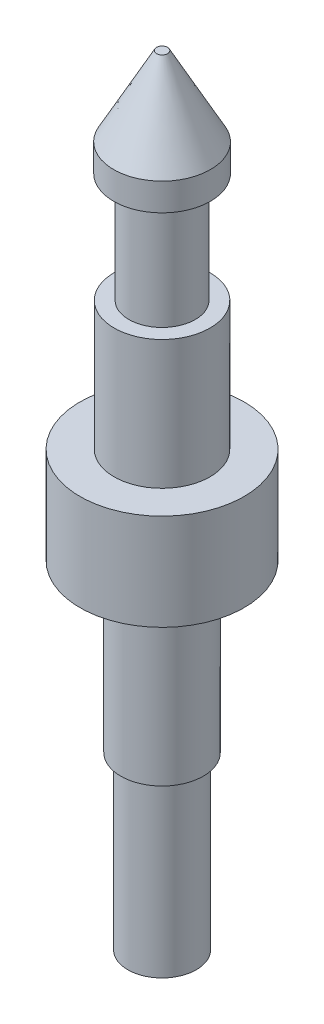
ISO-10303-21;
HEADER;
FILE_DESCRIPTION(('STEP AP214'),'2;1');
FILE_NAME('part.step','',(''),(''),'','','');
FILE_SCHEMA(('AUTOMOTIVE_DESIGN { 1 0 10303 214 1 1 1 1 }'));
ENDSEC;
DATA;
#1=APPLICATION_CONTEXT('core data for automotive mechanical design processes');
#2=APPLICATION_PROTOCOL_DEFINITION('international standard','automotive_design',2000,#1);
#3=PRODUCT_CONTEXT('',#1,'mechanical');
#4=PRODUCT('Part','Part','',(#3));
#5=PRODUCT_RELATED_PRODUCT_CATEGORY('part','',(#4));
#6=PRODUCT_DEFINITION_FORMATION('','',#4);
#7=PRODUCT_DEFINITION_CONTEXT('part definition',#1,'design');
#8=PRODUCT_DEFINITION('design','',#6,#7);
#9=PRODUCT_DEFINITION_SHAPE('','',#8);
#10=(LENGTH_UNIT() NAMED_UNIT(*) SI_UNIT(.MILLI.,.METRE.));
#11=(NAMED_UNIT(*) PLANE_ANGLE_UNIT() SI_UNIT($,.RADIAN.));
#12=(NAMED_UNIT(*) SI_UNIT($,.STERADIAN.) SOLID_ANGLE_UNIT());
#13=UNCERTAINTY_MEASURE_WITH_UNIT(LENGTH_MEASURE(1.E-05),#10,'distance_accuracy_value','');
#14=(GEOMETRIC_REPRESENTATION_CONTEXT(3) GLOBAL_UNCERTAINTY_ASSIGNED_CONTEXT((#13)) GLOBAL_UNIT_ASSIGNED_CONTEXT((#10,
#11,#12)) REPRESENTATION_CONTEXT('',''));
#15=CARTESIAN_POINT('',(0.,0.,0.));
#16=DIRECTION('',(0.,0.,1.));
#17=DIRECTION('',(1.,0.,0.));
#18=AXIS2_PLACEMENT_3D('',#15,#16,#17);
#19=CARTESIAN_POINT('',(0.,0.,0.));
#20=DIRECTION('',(0.,-1.,0.));
#21=DIRECTION('',(0.,0.,-1.));
#22=AXIS2_PLACEMENT_3D('',#19,#20,#21);
#23=PLANE('',#22);
#24=CARTESIAN_POINT('',(0.,0.,0.));
#25=DIRECTION('',(0.,-1.,0.));
#26=DIRECTION('',(0.,0.,-1.));
#27=AXIS2_PLACEMENT_3D('',#24,#25,#26);
#28=CIRCLE('',#27,1.9812);
#29=CARTESIAN_POINT('',(0.,0.,-1.9812));
#30=VERTEX_POINT('',#29);
#31=EDGE_CURVE('E10',#30,#30,#28,.T.);
#32=ORIENTED_EDGE('',*,*,#31,.T.);
#33=EDGE_LOOP('',(#32));
#34=FACE_BOUND('',#33,.T.);
#35=ADVANCED_FACE('F33',(#34),#23,.T.);
#36=CARTESIAN_POINT('',(0.,0.,0.));
#37=DIRECTION('',(0.,-1.,0.));
#38=DIRECTION('',(0.,0.,-1.));
#39=AXIS2_PLACEMENT_3D('',#36,#37,#38);
#40=CYLINDRICAL_SURFACE('',#39,1.9812);
#41=CARTESIAN_POINT('',(0.,9.8806,0.));
#42=DIRECTION('',(0.,-1.,0.));
#43=DIRECTION('',(0.,0.,-1.));
#44=AXIS2_PLACEMENT_3D('',#41,#42,#43);
#45=CIRCLE('',#44,1.9812);
#46=CARTESIAN_POINT('',(0.,9.8806,-1.9812));
#47=VERTEX_POINT('',#46);
#48=EDGE_CURVE('E39',#47,#47,#45,.T.);
#49=ORIENTED_EDGE('',*,*,#48,.T.);
#50=EDGE_LOOP('',(#49));
#51=FACE_BOUND('',#50,.T.);
#52=ORIENTED_EDGE('',*,*,#31,.F.);
#53=EDGE_LOOP('',(#52));
#54=FACE_BOUND('',#53,.T.);
#55=ADVANCED_FACE('F92',(#51,#54),#40,.T.);
#56=CARTESIAN_POINT('',(2.38125,9.8806,0.));
#57=DIRECTION('',(0.,-1.,0.));
#58=DIRECTION('',(0.,0.,-1.));
#59=AXIS2_PLACEMENT_3D('',#56,#57,#58);
#60=PLANE('',#59);
#61=CARTESIAN_POINT('',(0.,9.8806,0.));
#62=DIRECTION('',(0.,-1.,0.));
#63=DIRECTION('',(0.,0.,-1.));
#64=AXIS2_PLACEMENT_3D('',#61,#62,#63);
#65=CIRCLE('',#64,2.38125);
#66=CARTESIAN_POINT('',(0.,9.8806,-2.38125));
#67=VERTEX_POINT('',#66);
#68=EDGE_CURVE('E43',#67,#67,#65,.T.);
#69=ORIENTED_EDGE('',*,*,#68,.T.);
#70=EDGE_LOOP('',(#69));
#71=FACE_BOUND('',#70,.T.);
#72=ORIENTED_EDGE('',*,*,#48,.F.);
#73=EDGE_LOOP('',(#72));
#74=FACE_BOUND('',#73,.T.);
#75=ADVANCED_FACE('F96',(#71,#74),#60,.T.);
#76=CARTESIAN_POINT('',(0.,0.,0.));
#77=DIRECTION('',(0.,-1.,0.));
#78=DIRECTION('',(0.,0.,-1.));
#79=AXIS2_PLACEMENT_3D('',#76,#77,#78);
#80=CYLINDRICAL_SURFACE('',#79,2.38125);
#81=CARTESIAN_POINT('',(0.,19.4818,0.));
#82=DIRECTION('',(0.,-1.,0.));
#83=DIRECTION('',(0.,0.,-1.));
#84=AXIS2_PLACEMENT_3D('',#81,#82,#83);
#85=CIRCLE('',#84,2.38125);
#86=CARTESIAN_POINT('',(0.,19.4818,-2.38125));
#87=VERTEX_POINT('',#86);
#88=EDGE_CURVE('E47',#87,#87,#85,.T.);
#89=ORIENTED_EDGE('',*,*,#88,.T.);
#90=EDGE_LOOP('',(#89));
#91=FACE_BOUND('',#90,.T.);
#92=ORIENTED_EDGE('',*,*,#68,.F.);
#93=EDGE_LOOP('',(#92));
#94=FACE_BOUND('',#93,.T.);
#95=ADVANCED_FACE('F100',(#91,#94),#80,.T.);
#96=CARTESIAN_POINT('',(2.38125,19.4818,0.));
#97=DIRECTION('',(0.,-1.,0.));
#98=DIRECTION('',(0.,0.,-1.));
#99=AXIS2_PLACEMENT_3D('',#96,#97,#98);
#100=PLANE('',#99);
#101=CARTESIAN_POINT('',(0.,19.4818,0.));
#102=DIRECTION('',(0.,-1.,0.));
#103=DIRECTION('',(0.,0.,-1.));
#104=AXIS2_PLACEMENT_3D('',#101,#102,#103);
#105=CIRCLE('',#104,4.7371);
#106=CARTESIAN_POINT('',(0.,19.4818,-4.7371));
#107=VERTEX_POINT('',#106);
#108=EDGE_CURVE('E52',#107,#107,#105,.T.);
#109=ORIENTED_EDGE('',*,*,#108,.T.);
#110=EDGE_LOOP('',(#109));
#111=FACE_BOUND('',#110,.T.);
#112=ORIENTED_EDGE('',*,*,#88,.F.);
#113=EDGE_LOOP('',(#112));
#114=FACE_BOUND('',#113,.T.);
#115=ADVANCED_FACE('F107',(#111,#114),#100,.T.);
#116=CARTESIAN_POINT('',(0.,0.,0.));
#117=DIRECTION('',(0.,-1.,0.));
#118=DIRECTION('',(0.,0.,-1.));
#119=AXIS2_PLACEMENT_3D('',#116,#117,#118);
#120=CYLINDRICAL_SURFACE('',#119,4.7371);
#121=CARTESIAN_POINT('',(0.,25.0444,0.));
#122=DIRECTION('',(0.,-1.,0.));
#123=DIRECTION('',(0.,0.,-1.));
#124=AXIS2_PLACEMENT_3D('',#121,#122,#123);
#125=CIRCLE('',#124,4.7371);
#126=CARTESIAN_POINT('',(0.,25.0444,-4.7371));
#127=VERTEX_POINT('',#126);
#128=EDGE_CURVE('E55',#127,#127,#125,.T.);
#129=ORIENTED_EDGE('',*,*,#128,.T.);
#130=EDGE_LOOP('',(#129));
#131=FACE_BOUND('',#130,.T.);
#132=ORIENTED_EDGE('',*,*,#108,.F.);
#133=EDGE_LOOP('',(#132));
#134=FACE_BOUND('',#133,.T.);
#135=ADVANCED_FACE('F111',(#131,#134),#120,.T.);
#136=CARTESIAN_POINT('',(2.7686,25.0444,0.));
#137=DIRECTION('',(0.,1.,0.));
#138=DIRECTION('',(0.,0.,1.));
#139=AXIS2_PLACEMENT_3D('',#136,#137,#138);
#140=PLANE('',#139);
#141=CARTESIAN_POINT('',(0.,25.0444,0.));
#142=DIRECTION('',(0.,-1.,0.));
#143=DIRECTION('',(0.,0.,-1.));
#144=AXIS2_PLACEMENT_3D('',#141,#142,#143);
#145=CIRCLE('',#144,2.7686);
#146=CARTESIAN_POINT('',(0.,25.0444,-2.7686));
#147=VERTEX_POINT('',#146);
#148=EDGE_CURVE('E58',#147,#147,#145,.T.);
#149=ORIENTED_EDGE('',*,*,#148,.T.);
#150=EDGE_LOOP('',(#149));
#151=FACE_BOUND('',#150,.T.);
#152=ORIENTED_EDGE('',*,*,#128,.F.);
#153=EDGE_LOOP('',(#152));
#154=FACE_BOUND('',#153,.T.);
#155=ADVANCED_FACE('F115',(#151,#154),#140,.T.);
#156=CARTESIAN_POINT('',(0.,0.,0.));
#157=DIRECTION('',(0.,-1.,0.));
#158=DIRECTION('',(0.,0.,-1.));
#159=AXIS2_PLACEMENT_3D('',#156,#157,#158);
#160=CYLINDRICAL_SURFACE('',#159,2.7686);
#161=CARTESIAN_POINT('',(0.,32.4866,0.));
#162=DIRECTION('',(0.,-1.,0.));
#163=DIRECTION('',(0.,0.,-1.));
#164=AXIS2_PLACEMENT_3D('',#161,#162,#163);
#165=CIRCLE('',#164,2.7686);
#166=CARTESIAN_POINT('',(0.,32.4866,-2.7686));
#167=VERTEX_POINT('',#166);
#168=EDGE_CURVE('E61',#167,#167,#165,.T.);
#169=ORIENTED_EDGE('',*,*,#168,.T.);
#170=EDGE_LOOP('',(#169));
#171=FACE_BOUND('',#170,.T.);
#172=ORIENTED_EDGE('',*,*,#148,.F.);
#173=EDGE_LOOP('',(#172));
#174=FACE_BOUND('',#173,.T.);
#175=ADVANCED_FACE('F119',(#171,#174),#160,.T.);
#176=CARTESIAN_POINT('',(2.7686,32.4866,0.));
#177=DIRECTION('',(0.,1.,0.));
#178=DIRECTION('',(0.,0.,1.));
#179=AXIS2_PLACEMENT_3D('',#176,#177,#178);
#180=PLANE('',#179);
#181=CARTESIAN_POINT('',(0.,32.4866,0.));
#182=DIRECTION('',(0.,-1.,0.));
#183=DIRECTION('',(0.,0.,-1.));
#184=AXIS2_PLACEMENT_3D('',#181,#182,#183);
#185=CIRCLE('',#184,1.9177);
#186=CARTESIAN_POINT('',(0.,32.4866,-1.9177));
#187=VERTEX_POINT('',#186);
#188=EDGE_CURVE('E64',#187,#187,#185,.T.);
#189=ORIENTED_EDGE('',*,*,#188,.T.);
#190=EDGE_LOOP('',(#189));
#191=FACE_BOUND('',#190,.T.);
#192=ORIENTED_EDGE('',*,*,#168,.F.);
#193=EDGE_LOOP('',(#192));
#194=FACE_BOUND('',#193,.T.);
#195=ADVANCED_FACE('F123',(#191,#194),#180,.T.);
#196=CARTESIAN_POINT('',(0.,0.,0.));
#197=DIRECTION('',(0.,-1.,0.));
#198=DIRECTION('',(0.,0.,-1.));
#199=AXIS2_PLACEMENT_3D('',#196,#197,#198);
#200=CYLINDRICAL_SURFACE('',#199,1.9177);
#201=CARTESIAN_POINT('',(0.,38.8366,0.));
#202=DIRECTION('',(0.,-1.,0.));
#203=DIRECTION('',(0.,0.,-1.));
#204=AXIS2_PLACEMENT_3D('',#201,#202,#203);
#205=CIRCLE('',#204,1.9177);
#206=CARTESIAN_POINT('',(0.,38.8366,-1.9177));
#207=VERTEX_POINT('',#206);
#208=EDGE_CURVE('E67',#207,#207,#205,.T.);
#209=ORIENTED_EDGE('',*,*,#208,.T.);
#210=EDGE_LOOP('',(#209));
#211=FACE_BOUND('',#210,.T.);
#212=ORIENTED_EDGE('',*,*,#188,.F.);
#213=EDGE_LOOP('',(#212));
#214=FACE_BOUND('',#213,.T.);
#215=ADVANCED_FACE('F127',(#211,#214),#200,.T.);
#216=CARTESIAN_POINT('',(1.9177,38.8366,0.));
#217=DIRECTION('',(0.,-1.,0.));
#218=DIRECTION('',(0.,0.,-1.));
#219=AXIS2_PLACEMENT_3D('',#216,#217,#218);
#220=PLANE('',#219);
#221=CARTESIAN_POINT('',(0.,38.8366,0.));
#222=DIRECTION('',(0.,-1.,0.));
#223=DIRECTION('',(0.,0.,-1.));
#224=AXIS2_PLACEMENT_3D('',#221,#222,#223);
#225=CIRCLE('',#224,2.794);
#226=CARTESIAN_POINT('',(0.,38.8366,-2.794));
#227=VERTEX_POINT('',#226);
#228=EDGE_CURVE('E70',#227,#227,#225,.T.);
#229=ORIENTED_EDGE('',*,*,#228,.T.);
#230=EDGE_LOOP('',(#229));
#231=FACE_BOUND('',#230,.T.);
#232=ORIENTED_EDGE('',*,*,#208,.F.);
#233=EDGE_LOOP('',(#232));
#234=FACE_BOUND('',#233,.T.);
#235=ADVANCED_FACE('F131',(#231,#234),#220,.T.);
#236=CARTESIAN_POINT('',(0.,0.,0.));
#237=DIRECTION('',(0.,-1.,0.));
#238=DIRECTION('',(0.,0.,-1.));
#239=AXIS2_PLACEMENT_3D('',#236,#237,#238);
#240=CYLINDRICAL_SURFACE('',#239,2.794);
#241=CARTESIAN_POINT('',(0.,40.4241,0.));
#242=DIRECTION('',(0.,-1.,0.));
#243=DIRECTION('',(0.,0.,-1.));
#244=AXIS2_PLACEMENT_3D('',#241,#242,#243);
#245=CIRCLE('',#244,2.794);
#246=CARTESIAN_POINT('',(0.,40.4241,-2.794));
#247=VERTEX_POINT('',#246);
#248=EDGE_CURVE('E73',#247,#247,#245,.T.);
#249=ORIENTED_EDGE('',*,*,#248,.T.);
#250=EDGE_LOOP('',(#249));
#251=FACE_BOUND('',#250,.T.);
#252=ORIENTED_EDGE('',*,*,#228,.F.);
#253=EDGE_LOOP('',(#252));
#254=FACE_BOUND('',#253,.T.);
#255=ADVANCED_FACE('F89',(#251,#254),#240,.T.);
#256=CARTESIAN_POINT('',(0.,40.4241,0.));
#257=DIRECTION('',(0.,-1.,0.));
#258=DIRECTION('',(0.,0.,-1.));
#259=AXIS2_PLACEMENT_3D('',#256,#257,#258);
#260=CONICAL_SURFACE('',#259,2.794,0.497588567601857);
#261=CARTESIAN_POINT('',(0.,44.9834,0.));
#262=DIRECTION('',(0.,-1.,0.));
#263=DIRECTION('',(0.,0.,-1.));
#264=AXIS2_PLACEMENT_3D('',#261,#262,#263);
#265=CIRCLE('',#264,0.3175);
#266=CARTESIAN_POINT('',(0.,44.9834,-0.3175));
#267=VERTEX_POINT('',#266);
#268=EDGE_CURVE('E76',#267,#267,#265,.T.);
#269=ORIENTED_EDGE('',*,*,#268,.T.);
#270=EDGE_LOOP('',(#269));
#271=FACE_BOUND('',#270,.T.);
#272=ORIENTED_EDGE('',*,*,#248,.F.);
#273=EDGE_LOOP('',(#272));
#274=FACE_BOUND('',#273,.T.);
#275=ADVANCED_FACE('F80',(#271,#274),#260,.T.);
#276=CARTESIAN_POINT('',(0.3175,44.9834,0.));
#277=DIRECTION('',(0.,1.,0.));
#278=DIRECTION('',(0.,0.,1.));
#279=AXIS2_PLACEMENT_3D('',#276,#277,#278);
#280=PLANE('',#279);
#281=ORIENTED_EDGE('',*,*,#268,.F.);
#282=EDGE_LOOP('',(#281));
#283=FACE_BOUND('',#282,.T.);
#284=ADVANCED_FACE('F83',(#283),#280,.T.);
#285=CLOSED_SHELL('',(#35,#55,#75,#95,#115,#135,#155,#175,#195,#215,#235,#255,#275,#284));
#286=MANIFOLD_SOLID_BREP('B2',#285);
#287=ADVANCED_BREP_SHAPE_REPRESENTATION('',(#18,#286),#14);
#288=SHAPE_DEFINITION_REPRESENTATION(#9,#287);
ENDSEC;
END-ISO-10303-21;
